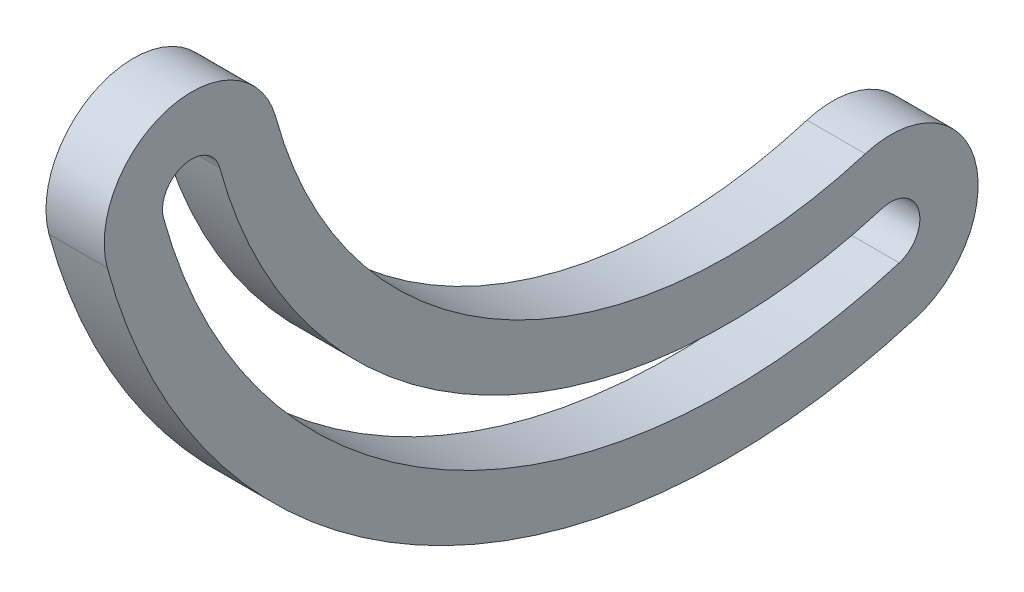
ISO-10303-21;
HEADER;
FILE_DESCRIPTION(('STEP AP214'),'2;1');
FILE_NAME('part.step','',(''),(''),'','','');
FILE_SCHEMA(('AUTOMOTIVE_DESIGN { 1 0 10303 214 1 1 1 1 }'));
ENDSEC;
DATA;
#1=APPLICATION_CONTEXT('core data for automotive mechanical design processes');
#2=APPLICATION_PROTOCOL_DEFINITION('international standard','automotive_design',2000,#1);
#3=PRODUCT_CONTEXT('',#1,'mechanical');
#4=PRODUCT('Part','Part','',(#3));
#5=PRODUCT_RELATED_PRODUCT_CATEGORY('part','',(#4));
#6=PRODUCT_DEFINITION_FORMATION('','',#4);
#7=PRODUCT_DEFINITION_CONTEXT('part definition',#1,'design');
#8=PRODUCT_DEFINITION('design','',#6,#7);
#9=PRODUCT_DEFINITION_SHAPE('','',#8);
#10=(LENGTH_UNIT() NAMED_UNIT(*) SI_UNIT(.MILLI.,.METRE.));
#11=(NAMED_UNIT(*) PLANE_ANGLE_UNIT() SI_UNIT($,.RADIAN.));
#12=(NAMED_UNIT(*) SI_UNIT($,.STERADIAN.) SOLID_ANGLE_UNIT());
#13=UNCERTAINTY_MEASURE_WITH_UNIT(LENGTH_MEASURE(1.E-05),#10,'distance_accuracy_value','');
#14=(GEOMETRIC_REPRESENTATION_CONTEXT(3) GLOBAL_UNCERTAINTY_ASSIGNED_CONTEXT((#13)) GLOBAL_UNIT_ASSIGNED_CONTEXT((#10,
#11,#12)) REPRESENTATION_CONTEXT('',''));
#15=CARTESIAN_POINT('',(0.,0.,0.));
#16=DIRECTION('',(0.,0.,1.));
#17=DIRECTION('',(1.,0.,0.));
#18=AXIS2_PLACEMENT_3D('',#15,#16,#17);
#19=CARTESIAN_POINT('',(6.35,7.93696588533694,-29.2661593245595));
#20=DIRECTION('',(1.,0.,0.));
#21=DIRECTION('',(0.,0.,-1.));
#22=AXIS2_PLACEMENT_3D('',#19,#20,#21);
#23=PLANE('',#22);
#24=CARTESIAN_POINT('',(6.35,0.,0.));
#25=DIRECTION('',(1.,0.,0.));
#26=DIRECTION('',(0.,0.,-1.));
#27=AXIS2_PLACEMENT_3D('',#24,#25,#26);
#28=CIRCLE('',#27,9.52500000000001);
#29=CARTESIAN_POINT('',(6.35,2.49311781754618,-9.19293144474779));
#30=VERTEX_POINT('',#29);
#31=CARTESIAN_POINT('',(6.35,-2.49311781754618,9.19293144474791));
#32=VERTEX_POINT('',#31);
#33=EDGE_CURVE('E156',#30,#32,#28,.T.);
#34=ORIENTED_EDGE('',*,*,#33,.T.);
#35=CARTESIAN_POINT('',(6.35,15.8739317706739,-58.532318649119));
#36=DIRECTION('',(1.,0.,0.));
#37=DIRECTION('',(0.,0.,-1.));
#38=AXIS2_PLACEMENT_3D('',#35,#36,#37);
#39=CIRCLE('',#38,70.1716325223587);
#40=CARTESIAN_POINT('',(6.35,-51.2540158857399,-78.9748393912077));
#41=VERTEX_POINT('',#40);
#42=EDGE_CURVE('E160',#32,#41,#39,.T.);
#43=ORIENTED_EDGE('',*,*,#42,.T.);
#44=CARTESIAN_POINT('',(6.35,-42.1421614447931,-76.1999999999999));
#45=DIRECTION('',(1.,0.,0.));
#46=DIRECTION('',(0.,0.,-1.));
#47=AXIS2_PLACEMENT_3D('',#44,#45,#46);
#48=CIRCLE('',#47,9.525);
#49=CARTESIAN_POINT('',(6.35,-33.0303070038463,-73.4251606087922));
#50=VERTEX_POINT('',#49);
#51=EDGE_CURVE('E164',#41,#50,#48,.T.);
#52=ORIENTED_EDGE('',*,*,#51,.T.);
#53=CARTESIAN_POINT('',(6.35,15.8739317706739,-58.532318649119));
#54=DIRECTION('',(-1.,0.,0.));
#55=DIRECTION('',(0.,0.,-1.));
#56=AXIS2_PLACEMENT_3D('',#53,#54,#55);
#57=CIRCLE('',#56,51.1216325223587);
#58=EDGE_CURVE('E167',#50,#30,#57,.T.);
#59=ORIENTED_EDGE('',*,*,#58,.T.);
#60=EDGE_LOOP('',(#34,#43,#52,#59));
#61=FACE_BOUND('',#60,.T.);
#62=CARTESIAN_POINT('',(6.35,15.8739317706741,-58.5323186491191));
#63=DIRECTION('',(1.,0.,0.));
#64=DIRECTION('',(0.,0.,-1.));
#65=AXIS2_PLACEMENT_3D('',#62,#63,#64);
#66=CIRCLE('',#65,63.8216325223589);
#67=CARTESIAN_POINT('',(6.35,-0.831039272515408,3.06431048158266));
#68=VERTEX_POINT('',#67);
#69=CARTESIAN_POINT('',(6.35,-45.1794462584421,-77.1249464637359));
#70=VERTEX_POINT('',#69);
#71=EDGE_CURVE('E117',#68,#70,#66,.T.);
#72=ORIENTED_EDGE('',*,*,#71,.F.);
#73=CARTESIAN_POINT('',(6.35,0.,0.));
#74=DIRECTION('',(1.,0.,0.));
#75=DIRECTION('',(0.,0.,-1.));
#76=AXIS2_PLACEMENT_3D('',#73,#74,#75);
#77=CIRCLE('',#76,3.175);
#78=CARTESIAN_POINT('',(6.35,0.831039272515407,-3.06431048158258));
#79=VERTEX_POINT('',#78);
#80=EDGE_CURVE('E108',#79,#68,#77,.T.);
#81=ORIENTED_EDGE('',*,*,#80,.F.);
#82=CARTESIAN_POINT('',(6.35,15.8739317706741,-58.5323186491191));
#83=DIRECTION('',(-1.,0.,0.));
#84=DIRECTION('',(0.,0.,-1.));
#85=AXIS2_PLACEMENT_3D('',#82,#83,#84);
#86=CIRCLE('',#85,57.4716325223589);
#87=CARTESIAN_POINT('',(6.35,-39.1048766311442,-75.2750535362641));
#88=VERTEX_POINT('',#87);
#89=EDGE_CURVE('E134',#88,#79,#86,.T.);
#90=ORIENTED_EDGE('',*,*,#89,.F.);
#91=CARTESIAN_POINT('',(6.35,-42.1421614447931,-76.1999999999999));
#92=DIRECTION('',(1.,0.,0.));
#93=DIRECTION('',(0.,0.,-1.));
#94=AXIS2_PLACEMENT_3D('',#91,#92,#93);
#95=CIRCLE('',#94,3.17500000000001);
#96=EDGE_CURVE('E130',#70,#88,#95,.T.);
#97=ORIENTED_EDGE('',*,*,#96,.F.);
#98=EDGE_LOOP('',(#72,#81,#90,#97));
#99=FACE_BOUND('',#98,.T.);
#100=ADVANCED_FACE('F42',(#61,#99),#23,.T.);
#101=CARTESIAN_POINT('',(0.,7.93696588533694,-29.2661593245595));
#102=DIRECTION('',(1.,0.,0.));
#103=DIRECTION('',(0.,0.,-1.));
#104=AXIS2_PLACEMENT_3D('',#101,#102,#103);
#105=PLANE('',#104);
#106=CARTESIAN_POINT('',(0.,0.,0.));
#107=DIRECTION('',(1.,0.,0.));
#108=DIRECTION('',(0.,0.,-1.));
#109=AXIS2_PLACEMENT_3D('',#106,#107,#108);
#110=CIRCLE('',#109,9.52500000000001);
#111=CARTESIAN_POINT('',(0.,2.49311781754618,-9.19293144474779));
#112=VERTEX_POINT('',#111);
#113=CARTESIAN_POINT('',(0.,-2.49311781754618,9.19293144474791));
#114=VERTEX_POINT('',#113);
#115=EDGE_CURVE('E126',#112,#114,#110,.T.);
#116=ORIENTED_EDGE('',*,*,#115,.F.);
#117=CARTESIAN_POINT('',(0.,15.8739317706739,-58.532318649119));
#118=DIRECTION('',(-1.,0.,0.));
#119=DIRECTION('',(0.,0.,-1.));
#120=AXIS2_PLACEMENT_3D('',#117,#118,#119);
#121=CIRCLE('',#120,51.1216325223587);
#122=CARTESIAN_POINT('',(0.,-33.0303070038463,-73.4251606087922));
#123=VERTEX_POINT('',#122);
#124=EDGE_CURVE('E161',#123,#112,#121,.T.);
#125=ORIENTED_EDGE('',*,*,#124,.F.);
#126=CARTESIAN_POINT('',(0.,-42.1421614447931,-76.1999999999999));
#127=DIRECTION('',(1.,0.,0.));
#128=DIRECTION('',(0.,0.,-1.));
#129=AXIS2_PLACEMENT_3D('',#126,#127,#128);
#130=CIRCLE('',#129,9.525);
#131=CARTESIAN_POINT('',(0.,-51.2540158857399,-78.9748393912077));
#132=VERTEX_POINT('',#131);
#133=EDGE_CURVE('E177',#132,#123,#130,.T.);
#134=ORIENTED_EDGE('',*,*,#133,.F.);
#135=CARTESIAN_POINT('',(0.,15.8739317706739,-58.532318649119));
#136=DIRECTION('',(1.,0.,0.));
#137=DIRECTION('',(0.,0.,-1.));
#138=AXIS2_PLACEMENT_3D('',#135,#136,#137);
#139=CIRCLE('',#138,70.1716325223587);
#140=EDGE_CURVE('E174',#114,#132,#139,.T.);
#141=ORIENTED_EDGE('',*,*,#140,.F.);
#142=EDGE_LOOP('',(#116,#125,#134,#141));
#143=FACE_BOUND('',#142,.T.);
#144=CARTESIAN_POINT('',(0.,0.,0.));
#145=DIRECTION('',(1.,0.,0.));
#146=DIRECTION('',(0.,0.,-1.));
#147=AXIS2_PLACEMENT_3D('',#144,#145,#146);
#148=CIRCLE('',#147,3.175);
#149=CARTESIAN_POINT('',(0.,0.831039272515407,-3.06431048158258));
#150=VERTEX_POINT('',#149);
#151=CARTESIAN_POINT('',(0.,-0.831039272515408,3.06431048158266));
#152=VERTEX_POINT('',#151);
#153=EDGE_CURVE('E66',#150,#152,#148,.T.);
#154=ORIENTED_EDGE('',*,*,#153,.T.);
#155=CARTESIAN_POINT('',(0.,15.8739317706741,-58.5323186491191));
#156=DIRECTION('',(1.,0.,0.));
#157=DIRECTION('',(0.,0.,-1.));
#158=AXIS2_PLACEMENT_3D('',#155,#156,#157);
#159=CIRCLE('',#158,63.8216325223589);
#160=CARTESIAN_POINT('',(0.,-45.1794462584421,-77.1249464637359));
#161=VERTEX_POINT('',#160);
#162=EDGE_CURVE('E124',#152,#161,#159,.T.);
#163=ORIENTED_EDGE('',*,*,#162,.T.);
#164=CARTESIAN_POINT('',(0.,-42.1421614447931,-76.1999999999999));
#165=DIRECTION('',(1.,0.,0.));
#166=DIRECTION('',(0.,0.,-1.));
#167=AXIS2_PLACEMENT_3D('',#164,#165,#166);
#168=CIRCLE('',#167,3.17500000000001);
#169=CARTESIAN_POINT('',(0.,-39.1048766311442,-75.275053536264));
#170=VERTEX_POINT('',#169);
#171=EDGE_CURVE('E143',#161,#170,#168,.T.);
#172=ORIENTED_EDGE('',*,*,#171,.T.);
#173=CARTESIAN_POINT('',(0.,15.8739317706741,-58.5323186491191));
#174=DIRECTION('',(-1.,0.,0.));
#175=DIRECTION('',(0.,0.,-1.));
#176=AXIS2_PLACEMENT_3D('',#173,#174,#175);
#177=CIRCLE('',#176,57.4716325223589);
#178=EDGE_CURVE('E118',#170,#150,#177,.T.);
#179=ORIENTED_EDGE('',*,*,#178,.T.);
#180=EDGE_LOOP('',(#154,#163,#172,#179));
#181=FACE_BOUND('',#180,.T.);
#182=ADVANCED_FACE('F200',(#143,#181),#105,.F.);
#183=CARTESIAN_POINT('',(6.35,0.,0.));
#184=DIRECTION('',(-1.,0.,0.));
#185=DIRECTION('',(0.,0.,1.));
#186=AXIS2_PLACEMENT_3D('',#183,#184,#185);
#187=CYLINDRICAL_SURFACE('',#186,9.52500000000001);
#188=ORIENTED_EDGE('',*,*,#115,.T.);
#189=DIRECTION('',(-1.,0.,0.));
#190=VECTOR('',#189,1.);
#191=CARTESIAN_POINT('',(6.35,-2.49311781754618,9.19293144474791));
#192=LINE('',#191,#190);
#193=EDGE_CURVE('E11',#32,#114,#192,.T.);
#194=ORIENTED_EDGE('',*,*,#193,.F.);
#195=ORIENTED_EDGE('',*,*,#33,.F.);
#196=DIRECTION('',(-1.,0.,0.));
#197=VECTOR('',#196,1.);
#198=CARTESIAN_POINT('',(6.35,2.49311781754618,-9.19293144474779));
#199=LINE('',#198,#197);
#200=EDGE_CURVE('E170',#30,#112,#199,.T.);
#201=ORIENTED_EDGE('',*,*,#200,.T.);
#202=EDGE_LOOP('',(#188,#194,#195,#201));
#203=FACE_BOUND('',#202,.T.);
#204=ADVANCED_FACE('F44',(#203),#187,.T.);
#205=CARTESIAN_POINT('',(6.35,15.8739317706739,-58.532318649119));
#206=DIRECTION('',(-1.,0.,0.));
#207=DIRECTION('',(0.,0.,1.));
#208=AXIS2_PLACEMENT_3D('',#205,#206,#207);
#209=CYLINDRICAL_SURFACE('',#208,70.1716325223587);
#210=ORIENTED_EDGE('',*,*,#140,.T.);
#211=DIRECTION('',(-1.,0.,0.));
#212=VECTOR('',#211,1.);
#213=CARTESIAN_POINT('',(6.35,-51.2540158857399,-78.9748393912077));
#214=LINE('',#213,#212);
#215=EDGE_CURVE('E51',#41,#132,#214,.T.);
#216=ORIENTED_EDGE('',*,*,#215,.F.);
#217=ORIENTED_EDGE('',*,*,#42,.F.);
#218=ORIENTED_EDGE('',*,*,#193,.T.);
#219=EDGE_LOOP('',(#210,#216,#217,#218));
#220=FACE_BOUND('',#219,.T.);
#221=ADVANCED_FACE('F210',(#220),#209,.T.);
#222=CARTESIAN_POINT('',(6.35,-42.1421614447931,-76.1999999999999));
#223=DIRECTION('',(-1.,0.,0.));
#224=DIRECTION('',(0.,0.,1.));
#225=AXIS2_PLACEMENT_3D('',#222,#223,#224);
#226=CYLINDRICAL_SURFACE('',#225,9.525);
#227=ORIENTED_EDGE('',*,*,#133,.T.);
#228=DIRECTION('',(-1.,0.,0.));
#229=VECTOR('',#228,1.);
#230=CARTESIAN_POINT('',(6.35,-33.0303070038463,-73.4251606087922));
#231=LINE('',#230,#229);
#232=EDGE_CURVE('E185',#50,#123,#231,.T.);
#233=ORIENTED_EDGE('',*,*,#232,.F.);
#234=ORIENTED_EDGE('',*,*,#51,.F.);
#235=ORIENTED_EDGE('',*,*,#215,.T.);
#236=EDGE_LOOP('',(#227,#233,#234,#235));
#237=FACE_BOUND('',#236,.T.);
#238=ADVANCED_FACE('F194',(#237),#226,.T.);
#239=CARTESIAN_POINT('',(6.35,15.8739317706739,-58.532318649119));
#240=DIRECTION('',(-1.,0.,0.));
#241=DIRECTION('',(0.,0.,1.));
#242=AXIS2_PLACEMENT_3D('',#239,#240,#241);
#243=CYLINDRICAL_SURFACE('',#242,51.1216325223587);
#244=ORIENTED_EDGE('',*,*,#124,.T.);
#245=ORIENTED_EDGE('',*,*,#200,.F.);
#246=ORIENTED_EDGE('',*,*,#58,.F.);
#247=ORIENTED_EDGE('',*,*,#232,.T.);
#248=EDGE_LOOP('',(#244,#245,#246,#247));
#249=FACE_BOUND('',#248,.T.);
#250=ADVANCED_FACE('F204',(#249),#243,.F.);
#251=CARTESIAN_POINT('',(6.35,0.,0.));
#252=DIRECTION('',(-1.,0.,0.));
#253=DIRECTION('',(0.,0.,1.));
#254=AXIS2_PLACEMENT_3D('',#251,#252,#253);
#255=CYLINDRICAL_SURFACE('',#254,3.175);
#256=ORIENTED_EDGE('',*,*,#153,.F.);
#257=DIRECTION('',(-1.,0.,0.));
#258=VECTOR('',#257,1.);
#259=CARTESIAN_POINT('',(6.35,0.831039272515407,-3.06431048158258));
#260=LINE('',#259,#258);
#261=EDGE_CURVE('E112',#79,#150,#260,.T.);
#262=ORIENTED_EDGE('',*,*,#261,.F.);
#263=ORIENTED_EDGE('',*,*,#80,.T.);
#264=DIRECTION('',(-1.,0.,0.));
#265=VECTOR('',#264,1.);
#266=CARTESIAN_POINT('',(6.35,-0.831039272515408,3.06431048158266));
#267=LINE('',#266,#265);
#268=EDGE_CURVE('E111',#68,#152,#267,.T.);
#269=ORIENTED_EDGE('',*,*,#268,.T.);
#270=EDGE_LOOP('',(#256,#262,#263,#269));
#271=FACE_BOUND('',#270,.T.);
#272=ADVANCED_FACE('F110',(#271),#255,.F.);
#273=CARTESIAN_POINT('',(6.35,15.8739317706741,-58.5323186491191));
#274=DIRECTION('',(-1.,0.,0.));
#275=DIRECTION('',(0.,0.,1.));
#276=AXIS2_PLACEMENT_3D('',#273,#274,#275);
#277=CYLINDRICAL_SURFACE('',#276,63.8216325223589);
#278=ORIENTED_EDGE('',*,*,#162,.F.);
#279=ORIENTED_EDGE('',*,*,#268,.F.);
#280=ORIENTED_EDGE('',*,*,#71,.T.);
#281=DIRECTION('',(-1.,0.,0.));
#282=VECTOR('',#281,1.);
#283=CARTESIAN_POINT('',(6.35,-45.1794462584421,-77.1249464637359));
#284=LINE('',#283,#282);
#285=EDGE_CURVE('E127',#70,#161,#284,.T.);
#286=ORIENTED_EDGE('',*,*,#285,.T.);
#287=EDGE_LOOP('',(#278,#279,#280,#286));
#288=FACE_BOUND('',#287,.T.);
#289=ADVANCED_FACE('F121',(#288),#277,.F.);
#290=CARTESIAN_POINT('',(6.35,-42.1421614447931,-76.1999999999999));
#291=DIRECTION('',(-1.,0.,0.));
#292=DIRECTION('',(0.,0.,1.));
#293=AXIS2_PLACEMENT_3D('',#290,#291,#292);
#294=CYLINDRICAL_SURFACE('',#293,3.17500000000001);
#295=ORIENTED_EDGE('',*,*,#171,.F.);
#296=ORIENTED_EDGE('',*,*,#285,.F.);
#297=ORIENTED_EDGE('',*,*,#96,.T.);
#298=DIRECTION('',(-1.,0.,0.));
#299=VECTOR('',#298,1.);
#300=CARTESIAN_POINT('',(6.35,-39.1048766311442,-75.275053536264));
#301=LINE('',#300,#299);
#302=EDGE_CURVE('E58',#88,#170,#301,.T.);
#303=ORIENTED_EDGE('',*,*,#302,.T.);
#304=EDGE_LOOP('',(#295,#296,#297,#303));
#305=FACE_BOUND('',#304,.T.);
#306=ADVANCED_FACE('F233',(#305),#294,.F.);
#307=CARTESIAN_POINT('',(6.35,15.8739317706741,-58.5323186491191));
#308=DIRECTION('',(-1.,0.,0.));
#309=DIRECTION('',(0.,0.,1.));
#310=AXIS2_PLACEMENT_3D('',#307,#308,#309);
#311=CYLINDRICAL_SURFACE('',#310,57.4716325223589);
#312=ORIENTED_EDGE('',*,*,#178,.F.);
#313=ORIENTED_EDGE('',*,*,#302,.F.);
#314=ORIENTED_EDGE('',*,*,#89,.T.);
#315=ORIENTED_EDGE('',*,*,#261,.T.);
#316=EDGE_LOOP('',(#312,#313,#314,#315));
#317=FACE_BOUND('',#316,.T.);
#318=ADVANCED_FACE('F237',(#317),#311,.T.);
#319=CLOSED_SHELL('',(#100,#182,#204,#221,#238,#250,#272,#289,#306,#318));
#320=MANIFOLD_SOLID_BREP('B2',#319);
#321=ADVANCED_BREP_SHAPE_REPRESENTATION('',(#18,#320),#14);
#322=SHAPE_DEFINITION_REPRESENTATION(#9,#321);
ENDSEC;
END-ISO-10303-21;
